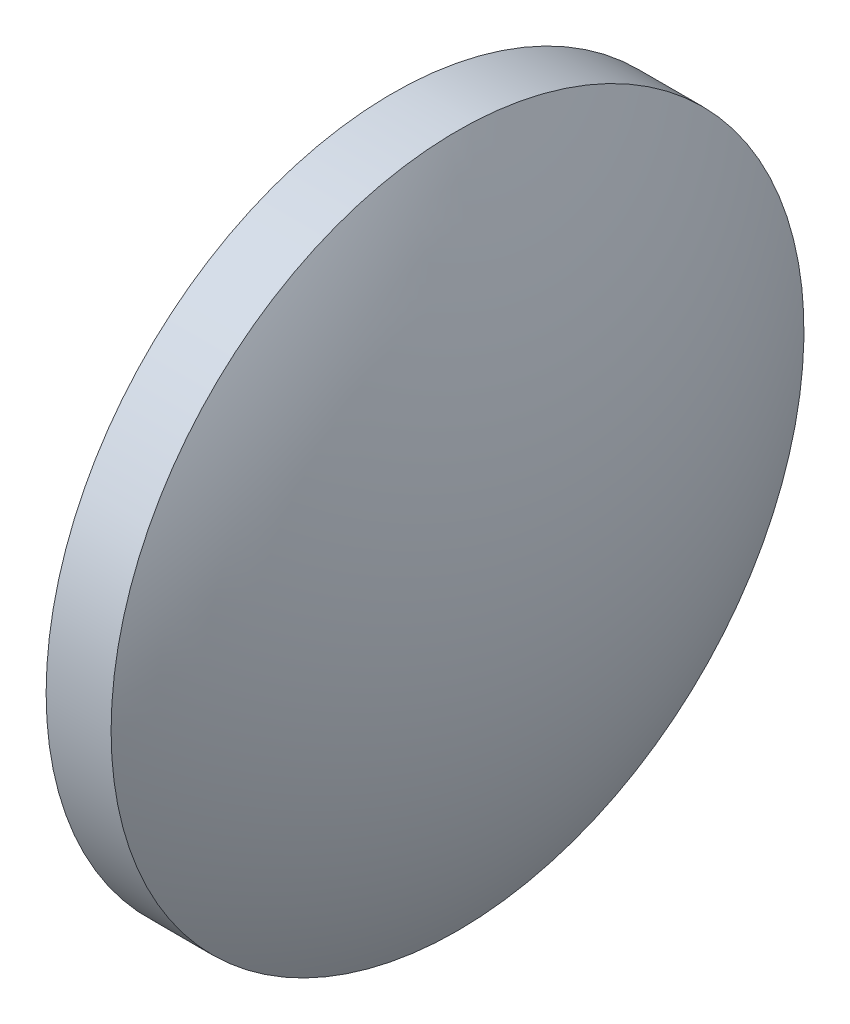
ISO-10303-21;
HEADER;
FILE_DESCRIPTION(('STEP AP214'),'2;1');
FILE_NAME('part.step','',(''),(''),'','','');
FILE_SCHEMA(('AUTOMOTIVE_DESIGN { 1 0 10303 214 1 1 1 1 }'));
ENDSEC;
DATA;
#1=APPLICATION_CONTEXT('core data for automotive mechanical design processes');
#2=APPLICATION_PROTOCOL_DEFINITION('international standard','automotive_design',2000,#1);
#3=PRODUCT_CONTEXT('',#1,'mechanical');
#4=PRODUCT('Part','Part','',(#3));
#5=PRODUCT_RELATED_PRODUCT_CATEGORY('part','',(#4));
#6=PRODUCT_DEFINITION_FORMATION('','',#4);
#7=PRODUCT_DEFINITION_CONTEXT('part definition',#1,'design');
#8=PRODUCT_DEFINITION('design','',#6,#7);
#9=PRODUCT_DEFINITION_SHAPE('','',#8);
#10=(LENGTH_UNIT() NAMED_UNIT(*) SI_UNIT(.MILLI.,.METRE.));
#11=(NAMED_UNIT(*) PLANE_ANGLE_UNIT() SI_UNIT($,.RADIAN.));
#12=(NAMED_UNIT(*) SI_UNIT($,.STERADIAN.) SOLID_ANGLE_UNIT());
#13=UNCERTAINTY_MEASURE_WITH_UNIT(LENGTH_MEASURE(1.E-05),#10,'distance_accuracy_value','');
#14=(GEOMETRIC_REPRESENTATION_CONTEXT(3) GLOBAL_UNCERTAINTY_ASSIGNED_CONTEXT((#13)) GLOBAL_UNIT_ASSIGNED_CONTEXT((#10,
#11,#12)) REPRESENTATION_CONTEXT('',''));
#15=CARTESIAN_POINT('',(0.,0.,0.));
#16=DIRECTION('',(0.,0.,1.));
#17=DIRECTION('',(1.,0.,0.));
#18=AXIS2_PLACEMENT_3D('',#15,#16,#17);
#19=CARTESIAN_POINT('',(380.6015576799,34.8639285695757,0.));
#20=DIRECTION('',(-1.,0.,0.));
#21=DIRECTION('',(0.,-1.,0.));
#22=AXIS2_PLACEMENT_3D('',#19,#20,#21);
#23=SPHERICAL_SURFACE('',#22,16.2880952380952);
#24=CARTESIAN_POINT('',(394.789652917995,34.8639285695757,0.));
#25=DIRECTION('',(-1.,0.,0.));
#26=DIRECTION('',(0.,0.,1.));
#27=AXIS2_PLACEMENT_3D('',#24,#25,#26);
#28=CIRCLE('',#27,8.);
#29=CARTESIAN_POINT('',(394.789652917995,34.8639285695757,8.));
#30=VERTEX_POINT('',#29);
#31=EDGE_CURVE('E10',#30,#30,#28,.T.);
#32=ORIENTED_EDGE('',*,*,#31,.F.);
#33=EDGE_LOOP('',(#32));
#34=FACE_BOUND('',#33,.T.);
#35=ADVANCED_FACE('F35',(#34),#23,.T.);
#36=CARTESIAN_POINT('',(391.36683621315,34.8639285695757,0.));
#37=DIRECTION('',(-1.,0.,0.));
#38=DIRECTION('',(0.,0.,1.));
#39=AXIS2_PLACEMENT_3D('',#36,#37,#38);
#40=CYLINDRICAL_SURFACE('',#39,8.);
#41=CARTESIAN_POINT('',(393.289652917995,34.8639285695757,0.));
#42=DIRECTION('',(-1.,0.,0.));
#43=DIRECTION('',(0.,0.,1.));
#44=AXIS2_PLACEMENT_3D('',#41,#42,#43);
#45=CIRCLE('',#44,8.);
#46=CARTESIAN_POINT('',(393.289652917995,34.8639285695757,8.));
#47=VERTEX_POINT('',#46);
#48=EDGE_CURVE('E41',#47,#47,#45,.T.);
#49=ORIENTED_EDGE('',*,*,#48,.F.);
#50=EDGE_LOOP('',(#49));
#51=FACE_BOUND('',#50,.T.);
#52=ORIENTED_EDGE('',*,*,#31,.T.);
#53=EDGE_LOOP('',(#52));
#54=FACE_BOUND('',#53,.T.);
#55=ADVANCED_FACE('F49',(#51,#54),#40,.T.);
#56=CARTESIAN_POINT('',(393.289652917995,34.8639285695757,0.));
#57=DIRECTION('',(1.,0.,0.));
#58=DIRECTION('',(0.,0.,-1.));
#59=AXIS2_PLACEMENT_3D('',#56,#57,#58);
#60=PLANE('',#59);
#61=ORIENTED_EDGE('',*,*,#48,.T.);
#62=EDGE_LOOP('',(#61));
#63=FACE_BOUND('',#62,.T.);
#64=ADVANCED_FACE('F47',(#63),#60,.F.);
#65=CLOSED_SHELL('',(#35,#55,#64));
#66=MANIFOLD_SOLID_BREP('B2',#65);
#67=ADVANCED_BREP_SHAPE_REPRESENTATION('',(#18,#66),#14);
#68=SHAPE_DEFINITION_REPRESENTATION(#9,#67);
ENDSEC;
END-ISO-10303-21;
